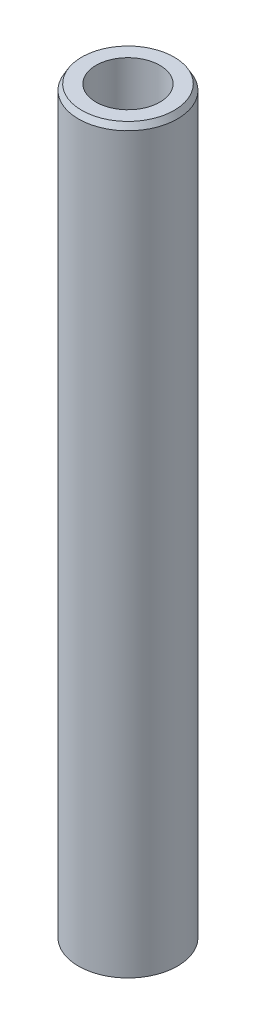
ISO-10303-21;
HEADER;
FILE_DESCRIPTION(('STEP AP214'),'2;1');
FILE_NAME('part.step','',(''),(''),'','','');
FILE_SCHEMA(('AUTOMOTIVE_DESIGN { 1 0 10303 214 1 1 1 1 }'));
ENDSEC;
DATA;
#1=APPLICATION_CONTEXT('core data for automotive mechanical design processes');
#2=APPLICATION_PROTOCOL_DEFINITION('international standard','automotive_design',2000,#1);
#3=PRODUCT_CONTEXT('',#1,'mechanical');
#4=PRODUCT('Part','Part','',(#3));
#5=PRODUCT_RELATED_PRODUCT_CATEGORY('part','',(#4));
#6=PRODUCT_DEFINITION_FORMATION('','',#4);
#7=PRODUCT_DEFINITION_CONTEXT('part definition',#1,'design');
#8=PRODUCT_DEFINITION('design','',#6,#7);
#9=PRODUCT_DEFINITION_SHAPE('','',#8);
#10=(LENGTH_UNIT() NAMED_UNIT(*) SI_UNIT(.MILLI.,.METRE.));
#11=(NAMED_UNIT(*) PLANE_ANGLE_UNIT() SI_UNIT($,.RADIAN.));
#12=(NAMED_UNIT(*) SI_UNIT($,.STERADIAN.) SOLID_ANGLE_UNIT());
#13=UNCERTAINTY_MEASURE_WITH_UNIT(LENGTH_MEASURE(1.E-05),#10,'distance_accuracy_value','');
#14=(GEOMETRIC_REPRESENTATION_CONTEXT(3) GLOBAL_UNCERTAINTY_ASSIGNED_CONTEXT((#13)) GLOBAL_UNIT_ASSIGNED_CONTEXT((#10,
#11,#12)) REPRESENTATION_CONTEXT('',''));
#15=CARTESIAN_POINT('',(0.,0.,0.));
#16=DIRECTION('',(0.,0.,1.));
#17=DIRECTION('',(1.,0.,0.));
#18=AXIS2_PLACEMENT_3D('',#15,#16,#17);
#19=CARTESIAN_POINT('',(0.,600.,0.));
#20=DIRECTION('',(0.,-1.,0.));
#21=DIRECTION('',(0.,0.,-1.));
#22=AXIS2_PLACEMENT_3D('',#19,#20,#21);
#23=CYLINDRICAL_SURFACE('',#22,40.);
#24=CARTESIAN_POINT('',(0.,595.352902776467,0.));
#25=DIRECTION('',(0.,1.,0.));
#26=DIRECTION('',(0.,0.,1.));
#27=AXIS2_PLACEMENT_3D('',#24,#25,#26);
#28=CIRCLE('',#27,40.);
#29=CARTESIAN_POINT('',(0.,595.352902776467,40.));
#30=VERTEX_POINT('',#29);
#31=EDGE_CURVE('E50',#30,#30,#28,.F.);
#32=ORIENTED_EDGE('',*,*,#31,.T.);
#33=EDGE_LOOP('',(#32));
#34=FACE_BOUND('',#33,.T.);
#35=CARTESIAN_POINT('',(0.,2.68300283295708,0.));
#36=DIRECTION('',(0.,1.,0.));
#37=DIRECTION('',(0.,0.,1.));
#38=AXIS2_PLACEMENT_3D('',#35,#36,#37);
#39=CIRCLE('',#38,40.);
#40=CARTESIAN_POINT('',(0.,2.68300283295708,40.));
#41=VERTEX_POINT('',#40);
#42=EDGE_CURVE('E51',#41,#41,#39,.T.);
#43=ORIENTED_EDGE('',*,*,#42,.T.);
#44=EDGE_LOOP('',(#43));
#45=FACE_BOUND('',#44,.T.);
#46=ADVANCED_FACE('F39',(#34,#45),#23,.T.);
#47=CARTESIAN_POINT('',(0.,600.,0.));
#48=DIRECTION('',(0.,1.,0.));
#49=DIRECTION('',(0.,0.,1.));
#50=AXIS2_PLACEMENT_3D('',#47,#48,#49);
#51=PLANE('',#50);
#52=CARTESIAN_POINT('',(0.,600.,0.));
#53=DIRECTION('',(0.,1.,0.));
#54=DIRECTION('',(0.,0.,1.));
#55=AXIS2_PLACEMENT_3D('',#52,#53,#54);
#56=CIRCLE('',#55,37.316997167043);
#57=CARTESIAN_POINT('',(0.,600.,37.316997167043));
#58=VERTEX_POINT('',#57);
#59=EDGE_CURVE('E54',#58,#58,#56,.T.);
#60=ORIENTED_EDGE('',*,*,#59,.T.);
#61=EDGE_LOOP('',(#60));
#62=FACE_BOUND('',#61,.T.);
#63=CARTESIAN_POINT('',(0.,600.,0.));
#64=DIRECTION('',(0.,1.,0.));
#65=DIRECTION('',(0.,0.,1.));
#66=AXIS2_PLACEMENT_3D('',#63,#64,#65);
#67=CIRCLE('',#66,25.794841620563);
#68=CARTESIAN_POINT('',(0.,600.,25.794841620563));
#69=VERTEX_POINT('',#68);
#70=EDGE_CURVE('E58',#69,#69,#67,.T.);
#71=ORIENTED_EDGE('',*,*,#70,.F.);
#72=EDGE_LOOP('',(#71));
#73=FACE_BOUND('',#72,.T.);
#74=ADVANCED_FACE('F69',(#62,#73),#51,.T.);
#75=CARTESIAN_POINT('',(0.,0.,0.));
#76=DIRECTION('',(0.,1.,0.));
#77=DIRECTION('',(0.,0.,1.));
#78=AXIS2_PLACEMENT_3D('',#75,#76,#77);
#79=PLANE('',#78);
#80=CARTESIAN_POINT('',(0.,0.,0.));
#81=DIRECTION('',(0.,1.,0.));
#82=DIRECTION('',(0.,0.,1.));
#83=AXIS2_PLACEMENT_3D('',#80,#81,#82);
#84=CIRCLE('',#83,35.3529027764672);
#85=CARTESIAN_POINT('',(0.,0.,35.3529027764672));
#86=VERTEX_POINT('',#85);
#87=EDGE_CURVE('E10',#86,#86,#84,.F.);
#88=ORIENTED_EDGE('',*,*,#87,.T.);
#89=EDGE_LOOP('',(#88));
#90=FACE_BOUND('',#89,.T.);
#91=CARTESIAN_POINT('',(0.,0.,0.));
#92=DIRECTION('',(0.,1.,0.));
#93=DIRECTION('',(0.,0.,1.));
#94=AXIS2_PLACEMENT_3D('',#91,#92,#93);
#95=CIRCLE('',#94,25.794841620563);
#96=CARTESIAN_POINT('',(0.,0.,25.794841620563));
#97=VERTEX_POINT('',#96);
#98=EDGE_CURVE('E63',#97,#97,#95,.T.);
#99=ORIENTED_EDGE('',*,*,#98,.T.);
#100=EDGE_LOOP('',(#99));
#101=FACE_BOUND('',#100,.T.);
#102=ADVANCED_FACE('F75',(#90,#101),#79,.F.);
#103=CARTESIAN_POINT('',(0.,600.,0.));
#104=DIRECTION('',(0.,-1.,0.));
#105=DIRECTION('',(0.,0.,-1.));
#106=AXIS2_PLACEMENT_3D('',#103,#104,#105);
#107=CYLINDRICAL_SURFACE('',#106,25.794841620563);
#108=ORIENTED_EDGE('',*,*,#70,.T.);
#109=EDGE_LOOP('',(#108));
#110=FACE_BOUND('',#109,.T.);
#111=ORIENTED_EDGE('',*,*,#98,.F.);
#112=EDGE_LOOP('',(#111));
#113=FACE_BOUND('',#112,.T.);
#114=ADVANCED_FACE('F70',(#110,#113),#107,.F.);
#115=CARTESIAN_POINT('',(0.,600.,0.));
#116=DIRECTION('',(0.,-1.,0.));
#117=DIRECTION('',(0.,0.,-1.));
#118=AXIS2_PLACEMENT_3D('',#115,#116,#117);
#119=CONICAL_SURFACE('',#118,37.316997167043,0.523598775598308);
#120=ORIENTED_EDGE('',*,*,#31,.F.);
#121=EDGE_LOOP('',(#120));
#122=FACE_BOUND('',#121,.T.);
#123=ORIENTED_EDGE('',*,*,#59,.F.);
#124=EDGE_LOOP('',(#123));
#125=FACE_BOUND('',#124,.T.);
#126=ADVANCED_FACE('F81',(#122,#125),#119,.T.);
#127=CARTESIAN_POINT('',(0.,2.68300283295708,0.));
#128=DIRECTION('',(0.,1.,0.));
#129=DIRECTION('',(0.,0.,1.));
#130=AXIS2_PLACEMENT_3D('',#127,#128,#129);
#131=CONICAL_SURFACE('',#130,40.,1.04719755119659);
#132=ORIENTED_EDGE('',*,*,#87,.F.);
#133=EDGE_LOOP('',(#132));
#134=FACE_BOUND('',#133,.T.);
#135=ORIENTED_EDGE('',*,*,#42,.F.);
#136=EDGE_LOOP('',(#135));
#137=FACE_BOUND('',#136,.T.);
#138=ADVANCED_FACE('F45',(#134,#137),#131,.T.);
#139=CLOSED_SHELL('',(#46,#74,#102,#114,#126,#138));
#140=MANIFOLD_SOLID_BREP('B2',#139);
#141=ADVANCED_BREP_SHAPE_REPRESENTATION('',(#18,#140),#14);
#142=SHAPE_DEFINITION_REPRESENTATION(#9,#141);
ENDSEC;
END-ISO-10303-21;
